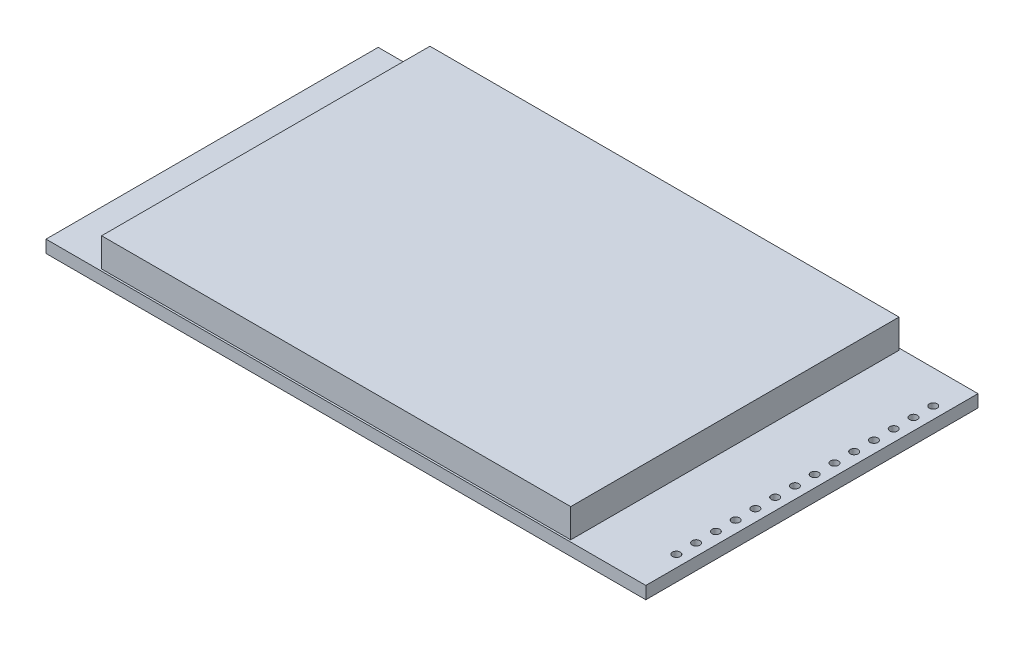
ISO-10303-21;
HEADER;
FILE_DESCRIPTION(('STEP AP214'),'2;1');
FILE_NAME('part.step','',(''),(''),'','','');
FILE_SCHEMA(('AUTOMOTIVE_DESIGN { 1 0 10303 214 1 1 1 1 }'));
ENDSEC;
DATA;
#1=APPLICATION_CONTEXT('core data for automotive mechanical design processes');
#2=APPLICATION_PROTOCOL_DEFINITION('international standard','automotive_design',2000,#1);
#3=PRODUCT_CONTEXT('',#1,'mechanical');
#4=PRODUCT('Part','Part','',(#3));
#5=PRODUCT_RELATED_PRODUCT_CATEGORY('part','',(#4));
#6=PRODUCT_DEFINITION_FORMATION('','',#4);
#7=PRODUCT_DEFINITION_CONTEXT('part definition',#1,'design');
#8=PRODUCT_DEFINITION('design','',#6,#7);
#9=PRODUCT_DEFINITION_SHAPE('','',#8);
#10=(LENGTH_UNIT() NAMED_UNIT(*) SI_UNIT(.MILLI.,.METRE.));
#11=(NAMED_UNIT(*) PLANE_ANGLE_UNIT() SI_UNIT($,.RADIAN.));
#12=(NAMED_UNIT(*) SI_UNIT($,.STERADIAN.) SOLID_ANGLE_UNIT());
#13=UNCERTAINTY_MEASURE_WITH_UNIT(LENGTH_MEASURE(1.E-05),#10,'distance_accuracy_value','');
#14=(GEOMETRIC_REPRESENTATION_CONTEXT(3) GLOBAL_UNCERTAINTY_ASSIGNED_CONTEXT((#13)) GLOBAL_UNIT_ASSIGNED_CONTEXT((#10,
#11,#12)) REPRESENTATION_CONTEXT('',''));
#15=CARTESIAN_POINT('',(0.,0.,0.));
#16=DIRECTION('',(0.,0.,1.));
#17=DIRECTION('',(1.,0.,0.));
#18=AXIS2_PLACEMENT_3D('',#15,#16,#17);
#19=CARTESIAN_POINT('',(0.,1.6,0.));
#20=DIRECTION('',(0.,1.,0.));
#21=DIRECTION('',(0.,0.,1.));
#22=AXIS2_PLACEMENT_3D('',#19,#20,#21);
#23=PLANE('',#22);
#24=CARTESIAN_POINT('',(37.05,1.6,13.3832355077745));
#25=DIRECTION('',(0.,1.,0.));
#26=DIRECTION('',(0.,0.,1.));
#27=AXIS2_PLACEMENT_3D('',#24,#25,#26);
#28=CIRCLE('',#27,0.499999999999999);
#29=CARTESIAN_POINT('',(37.05,1.6,13.8832355077745));
#30=VERTEX_POINT('',#29);
#31=EDGE_CURVE('E267',#30,#30,#28,.T.);
#32=ORIENTED_EDGE('',*,*,#31,.F.);
#33=EDGE_LOOP('',(#32));
#34=FACE_BOUND('',#33,.T.);
#35=CARTESIAN_POINT('',(37.05,1.6,10.8432355077745));
#36=DIRECTION('',(0.,1.,0.));
#37=DIRECTION('',(0.,0.,1.));
#38=AXIS2_PLACEMENT_3D('',#35,#36,#37);
#39=CIRCLE('',#38,0.499999999999999);
#40=CARTESIAN_POINT('',(37.05,1.6,11.3432355077745));
#41=VERTEX_POINT('',#40);
#42=EDGE_CURVE('E278',#41,#41,#39,.T.);
#43=ORIENTED_EDGE('',*,*,#42,.F.);
#44=EDGE_LOOP('',(#43));
#45=FACE_BOUND('',#44,.T.);
#46=CARTESIAN_POINT('',(37.05,1.6,8.30323550777446));
#47=DIRECTION('',(0.,1.,0.));
#48=DIRECTION('',(0.,0.,1.));
#49=AXIS2_PLACEMENT_3D('',#46,#47,#48);
#50=CIRCLE('',#49,0.499999999999999);
#51=CARTESIAN_POINT('',(37.05,1.6,8.80323550777446));
#52=VERTEX_POINT('',#51);
#53=EDGE_CURVE('E284',#52,#52,#50,.T.);
#54=ORIENTED_EDGE('',*,*,#53,.F.);
#55=EDGE_LOOP('',(#54));
#56=FACE_BOUND('',#55,.T.);
#57=CARTESIAN_POINT('',(37.0499999999999,1.6,5.76323550777446));
#58=DIRECTION('',(0.,1.,0.));
#59=DIRECTION('',(0.,0.,1.));
#60=AXIS2_PLACEMENT_3D('',#57,#58,#59);
#61=CIRCLE('',#60,0.499999999999999);
#62=CARTESIAN_POINT('',(37.0499999999999,1.6,6.26323550777446));
#63=VERTEX_POINT('',#62);
#64=EDGE_CURVE('E290',#63,#63,#61,.T.);
#65=ORIENTED_EDGE('',*,*,#64,.F.);
#66=EDGE_LOOP('',(#65));
#67=FACE_BOUND('',#66,.T.);
#68=CARTESIAN_POINT('',(37.0499999999999,1.6,3.22323550777446));
#69=DIRECTION('',(0.,1.,0.));
#70=DIRECTION('',(0.,0.,1.));
#71=AXIS2_PLACEMENT_3D('',#68,#69,#70);
#72=CIRCLE('',#71,0.499999999999999);
#73=CARTESIAN_POINT('',(37.0499999999999,1.6,3.72323550777446));
#74=VERTEX_POINT('',#73);
#75=EDGE_CURVE('E296',#74,#74,#72,.T.);
#76=ORIENTED_EDGE('',*,*,#75,.F.);
#77=EDGE_LOOP('',(#76));
#78=FACE_BOUND('',#77,.T.);
#79=CARTESIAN_POINT('',(37.0499999999999,1.6,0.683235507774462));
#80=DIRECTION('',(0.,1.,0.));
#81=DIRECTION('',(0.,0.,1.));
#82=AXIS2_PLACEMENT_3D('',#79,#80,#81);
#83=CIRCLE('',#82,0.499999999999999);
#84=CARTESIAN_POINT('',(37.0499999999999,1.6,1.18323550777446));
#85=VERTEX_POINT('',#84);
#86=EDGE_CURVE('E302',#85,#85,#83,.T.);
#87=ORIENTED_EDGE('',*,*,#86,.F.);
#88=EDGE_LOOP('',(#87));
#89=FACE_BOUND('',#88,.T.);
#90=CARTESIAN_POINT('',(37.0499999999999,1.6,-1.85676449222554));
#91=DIRECTION('',(0.,1.,0.));
#92=DIRECTION('',(0.,0.,1.));
#93=AXIS2_PLACEMENT_3D('',#90,#91,#92);
#94=CIRCLE('',#93,0.499999999999999);
#95=CARTESIAN_POINT('',(37.0499999999999,1.6,-1.35676449222554));
#96=VERTEX_POINT('',#95);
#97=EDGE_CURVE('E308',#96,#96,#94,.T.);
#98=ORIENTED_EDGE('',*,*,#97,.F.);
#99=EDGE_LOOP('',(#98));
#100=FACE_BOUND('',#99,.T.);
#101=CARTESIAN_POINT('',(37.0499999999999,1.6,-4.39676449222554));
#102=DIRECTION('',(0.,1.,0.));
#103=DIRECTION('',(0.,0.,1.));
#104=AXIS2_PLACEMENT_3D('',#101,#102,#103);
#105=CIRCLE('',#104,0.499999999999999);
#106=CARTESIAN_POINT('',(37.0499999999999,1.6,-3.89676449222554));
#107=VERTEX_POINT('',#106);
#108=EDGE_CURVE('E314',#107,#107,#105,.T.);
#109=ORIENTED_EDGE('',*,*,#108,.F.);
#110=EDGE_LOOP('',(#109));
#111=FACE_BOUND('',#110,.T.);
#112=CARTESIAN_POINT('',(37.0499999999999,1.6,-6.93676449222554));
#113=DIRECTION('',(0.,1.,0.));
#114=DIRECTION('',(0.,0.,1.));
#115=AXIS2_PLACEMENT_3D('',#112,#113,#114);
#116=CIRCLE('',#115,0.499999999999999);
#117=CARTESIAN_POINT('',(37.0499999999999,1.6,-6.43676449222554));
#118=VERTEX_POINT('',#117);
#119=EDGE_CURVE('E320',#118,#118,#116,.T.);
#120=ORIENTED_EDGE('',*,*,#119,.F.);
#121=EDGE_LOOP('',(#120));
#122=FACE_BOUND('',#121,.T.);
#123=CARTESIAN_POINT('',(37.0499999999999,1.6,-9.47676449222553));
#124=DIRECTION('',(0.,1.,0.));
#125=DIRECTION('',(0.,0.,1.));
#126=AXIS2_PLACEMENT_3D('',#123,#124,#125);
#127=CIRCLE('',#126,0.499999999999999);
#128=CARTESIAN_POINT('',(37.0499999999999,1.6,-8.97676449222553));
#129=VERTEX_POINT('',#128);
#130=EDGE_CURVE('E326',#129,#129,#127,.T.);
#131=ORIENTED_EDGE('',*,*,#130,.F.);
#132=EDGE_LOOP('',(#131));
#133=FACE_BOUND('',#132,.T.);
#134=CARTESIAN_POINT('',(37.0499999999999,1.6,-12.0167644922255));
#135=DIRECTION('',(0.,1.,0.));
#136=DIRECTION('',(0.,0.,1.));
#137=AXIS2_PLACEMENT_3D('',#134,#135,#136);
#138=CIRCLE('',#137,0.499999999999999);
#139=CARTESIAN_POINT('',(37.0499999999999,1.6,-11.5167644922255));
#140=VERTEX_POINT('',#139);
#141=EDGE_CURVE('E332',#140,#140,#138,.T.);
#142=ORIENTED_EDGE('',*,*,#141,.F.);
#143=EDGE_LOOP('',(#142));
#144=FACE_BOUND('',#143,.T.);
#145=CARTESIAN_POINT('',(37.0499999999999,1.6,-14.5567644922255));
#146=DIRECTION('',(0.,1.,0.));
#147=DIRECTION('',(0.,0.,1.));
#148=AXIS2_PLACEMENT_3D('',#145,#146,#147);
#149=CIRCLE('',#148,0.499999999999999);
#150=CARTESIAN_POINT('',(37.0499999999999,1.6,-14.0567644922255));
#151=VERTEX_POINT('',#150);
#152=EDGE_CURVE('E338',#151,#151,#149,.T.);
#153=ORIENTED_EDGE('',*,*,#152,.F.);
#154=EDGE_LOOP('',(#153));
#155=FACE_BOUND('',#154,.T.);
#156=CARTESIAN_POINT('',(37.0499999999999,1.6,-17.0967644922255));
#157=DIRECTION('',(0.,1.,0.));
#158=DIRECTION('',(0.,0.,1.));
#159=AXIS2_PLACEMENT_3D('',#156,#157,#158);
#160=CIRCLE('',#159,0.499999999999999);
#161=CARTESIAN_POINT('',(37.0499999999999,1.6,-16.5967644922255));
#162=VERTEX_POINT('',#161);
#163=EDGE_CURVE('E344',#162,#162,#160,.T.);
#164=ORIENTED_EDGE('',*,*,#163,.F.);
#165=EDGE_LOOP('',(#164));
#166=FACE_BOUND('',#165,.T.);
#167=CARTESIAN_POINT('',(37.05,1.6,15.9232355077745));
#168=DIRECTION('',(0.,1.,0.));
#169=DIRECTION('',(0.,0.,1.));
#170=AXIS2_PLACEMENT_3D('',#167,#168,#169);
#171=CIRCLE('',#170,0.499999999999999);
#172=CARTESIAN_POINT('',(37.05,1.6,16.4232355077745));
#173=VERTEX_POINT('',#172);
#174=EDGE_CURVE('E271',#173,#173,#171,.T.);
#175=ORIENTED_EDGE('',*,*,#174,.F.);
#176=EDGE_LOOP('',(#175));
#177=FACE_BOUND('',#176,.T.);
#178=DIRECTION('',(0.,0.,1.));
#179=VECTOR('',#178,1.);
#180=CARTESIAN_POINT('',(-38.55,1.6,21.35));
#181=LINE('',#180,#179);
#182=CARTESIAN_POINT('',(-38.55,1.6,-21.35));
#183=VERTEX_POINT('',#182);
#184=CARTESIAN_POINT('',(-38.55,1.6,21.35));
#185=VERTEX_POINT('',#184);
#186=EDGE_CURVE('E149',#183,#185,#181,.T.);
#187=ORIENTED_EDGE('',*,*,#186,.T.);
#188=DIRECTION('',(1.,0.,0.));
#189=VECTOR('',#188,1.);
#190=CARTESIAN_POINT('',(38.55,1.6,21.35));
#191=LINE('',#190,#189);
#192=CARTESIAN_POINT('',(38.55,1.6,21.35));
#193=VERTEX_POINT('',#192);
#194=EDGE_CURVE('E89',#185,#193,#191,.T.);
#195=ORIENTED_EDGE('',*,*,#194,.T.);
#196=DIRECTION('',(0.,0.,-1.));
#197=VECTOR('',#196,1.);
#198=CARTESIAN_POINT('',(38.55,1.6,21.35));
#199=LINE('',#198,#197);
#200=CARTESIAN_POINT('',(38.55,1.6,-21.35));
#201=VERTEX_POINT('',#200);
#202=EDGE_CURVE('E152',#193,#201,#199,.T.);
#203=ORIENTED_EDGE('',*,*,#202,.T.);
#204=DIRECTION('',(-1.,0.,0.));
#205=VECTOR('',#204,1.);
#206=CARTESIAN_POINT('',(38.55,1.6,-21.35));
#207=LINE('',#206,#205);
#208=EDGE_CURVE('E61',#201,#183,#207,.T.);
#209=ORIENTED_EDGE('',*,*,#208,.T.);
#210=EDGE_LOOP('',(#187,#195,#203,#209));
#211=FACE_BOUND('',#210,.T.);
#212=DIRECTION('',(1.,0.,0.));
#213=VECTOR('',#212,1.);
#214=CARTESIAN_POINT('',(28.65,1.6,21.1));
#215=LINE('',#214,#213);
#216=CARTESIAN_POINT('',(-31.65,1.6,21.1));
#217=VERTEX_POINT('',#216);
#218=CARTESIAN_POINT('',(28.65,1.6,21.1));
#219=VERTEX_POINT('',#218);
#220=EDGE_CURVE('E144',#217,#219,#215,.T.);
#221=ORIENTED_EDGE('',*,*,#220,.F.);
#222=DIRECTION('',(0.,0.,1.));
#223=VECTOR('',#222,1.);
#224=CARTESIAN_POINT('',(-31.65,1.6,21.1));
#225=LINE('',#224,#223);
#226=CARTESIAN_POINT('',(-31.65,1.6,-21.1));
#227=VERTEX_POINT('',#226);
#228=EDGE_CURVE('E138',#227,#217,#225,.T.);
#229=ORIENTED_EDGE('',*,*,#228,.F.);
#230=DIRECTION('',(-1.,0.,0.));
#231=VECTOR('',#230,1.);
#232=CARTESIAN_POINT('',(28.65,1.6,-21.1));
#233=LINE('',#232,#231);
#234=CARTESIAN_POINT('',(28.65,1.6,-21.1));
#235=VERTEX_POINT('',#234);
#236=EDGE_CURVE('E117',#235,#227,#233,.T.);
#237=ORIENTED_EDGE('',*,*,#236,.F.);
#238=DIRECTION('',(0.,0.,-1.));
#239=VECTOR('',#238,1.);
#240=CARTESIAN_POINT('',(28.65,1.6,21.1));
#241=LINE('',#240,#239);
#242=EDGE_CURVE('E52',#219,#235,#241,.T.);
#243=ORIENTED_EDGE('',*,*,#242,.F.);
#244=EDGE_LOOP('',(#221,#229,#237,#243));
#245=FACE_BOUND('',#244,.T.);
#246=ADVANCED_FACE('F37',(#34,#45,#56,#67,#78,#89,#100,#111,#122,#133,#144,#155,#166,#177,#211,
#245),#23,.T.);
#247=CARTESIAN_POINT('',(-38.55,1.6,21.35));
#248=DIRECTION('',(1.,0.,0.));
#249=DIRECTION('',(0.,0.,-1.));
#250=AXIS2_PLACEMENT_3D('',#247,#248,#249);
#251=PLANE('',#250);
#252=DIRECTION('',(0.,0.,1.));
#253=VECTOR('',#252,1.);
#254=CARTESIAN_POINT('',(-38.55,0.,21.35));
#255=LINE('',#254,#253);
#256=CARTESIAN_POINT('',(-38.55,0.,-21.35));
#257=VERTEX_POINT('',#256);
#258=CARTESIAN_POINT('',(-38.55,0.,21.35));
#259=VERTEX_POINT('',#258);
#260=EDGE_CURVE('E131',#257,#259,#255,.T.);
#261=ORIENTED_EDGE('',*,*,#260,.T.);
#262=DIRECTION('',(0.,-1.,0.));
#263=VECTOR('',#262,1.);
#264=CARTESIAN_POINT('',(-38.55,1.6,21.35));
#265=LINE('',#264,#263);
#266=EDGE_CURVE('E12',#185,#259,#265,.T.);
#267=ORIENTED_EDGE('',*,*,#266,.F.);
#268=ORIENTED_EDGE('',*,*,#186,.F.);
#269=DIRECTION('',(0.,-1.,0.));
#270=VECTOR('',#269,1.);
#271=CARTESIAN_POINT('',(-38.55,1.6,-21.35));
#272=LINE('',#271,#270);
#273=EDGE_CURVE('E154',#183,#257,#272,.T.);
#274=ORIENTED_EDGE('',*,*,#273,.T.);
#275=EDGE_LOOP('',(#261,#267,#268,#274));
#276=FACE_BOUND('',#275,.T.);
#277=ADVANCED_FACE('F39',(#276),#251,.F.);
#278=CARTESIAN_POINT('',(38.55,1.6,21.35));
#279=DIRECTION('',(0.,0.,-1.));
#280=DIRECTION('',(-1.,0.,0.));
#281=AXIS2_PLACEMENT_3D('',#278,#279,#280);
#282=PLANE('',#281);
#283=DIRECTION('',(1.,0.,0.));
#284=VECTOR('',#283,1.);
#285=CARTESIAN_POINT('',(38.55,0.,21.35));
#286=LINE('',#285,#284);
#287=CARTESIAN_POINT('',(38.55,0.,21.35));
#288=VERTEX_POINT('',#287);
#289=EDGE_CURVE('E134',#259,#288,#286,.T.);
#290=ORIENTED_EDGE('',*,*,#289,.T.);
#291=DIRECTION('',(0.,-1.,0.));
#292=VECTOR('',#291,1.);
#293=CARTESIAN_POINT('',(38.55,1.6,21.35));
#294=LINE('',#293,#292);
#295=EDGE_CURVE('E45',#193,#288,#294,.T.);
#296=ORIENTED_EDGE('',*,*,#295,.F.);
#297=ORIENTED_EDGE('',*,*,#194,.F.);
#298=ORIENTED_EDGE('',*,*,#266,.T.);
#299=EDGE_LOOP('',(#290,#296,#297,#298));
#300=FACE_BOUND('',#299,.T.);
#301=ADVANCED_FACE('F184',(#300),#282,.F.);
#302=CARTESIAN_POINT('',(38.55,1.6,21.35));
#303=DIRECTION('',(-1.,0.,0.));
#304=DIRECTION('',(0.,0.,1.));
#305=AXIS2_PLACEMENT_3D('',#302,#303,#304);
#306=PLANE('',#305);
#307=DIRECTION('',(0.,0.,-1.));
#308=VECTOR('',#307,1.);
#309=CARTESIAN_POINT('',(38.55,0.,21.35));
#310=LINE('',#309,#308);
#311=CARTESIAN_POINT('',(38.55,0.,-21.35));
#312=VERTEX_POINT('',#311);
#313=EDGE_CURVE('E157',#288,#312,#310,.T.);
#314=ORIENTED_EDGE('',*,*,#313,.T.);
#315=DIRECTION('',(0.,-1.,0.));
#316=VECTOR('',#315,1.);
#317=CARTESIAN_POINT('',(38.55,1.6,-21.35));
#318=LINE('',#317,#316);
#319=EDGE_CURVE('E161',#201,#312,#318,.T.);
#320=ORIENTED_EDGE('',*,*,#319,.F.);
#321=ORIENTED_EDGE('',*,*,#202,.F.);
#322=ORIENTED_EDGE('',*,*,#295,.T.);
#323=EDGE_LOOP('',(#314,#320,#321,#322));
#324=FACE_BOUND('',#323,.T.);
#325=ADVANCED_FACE('F166',(#324),#306,.F.);
#326=CARTESIAN_POINT('',(38.55,1.6,-21.35));
#327=DIRECTION('',(0.,0.,1.));
#328=DIRECTION('',(1.,0.,0.));
#329=AXIS2_PLACEMENT_3D('',#326,#327,#328);
#330=PLANE('',#329);
#331=DIRECTION('',(-1.,0.,0.));
#332=VECTOR('',#331,1.);
#333=CARTESIAN_POINT('',(38.55,0.,-21.35));
#334=LINE('',#333,#332);
#335=EDGE_CURVE('E82',#312,#257,#334,.T.);
#336=ORIENTED_EDGE('',*,*,#335,.T.);
#337=ORIENTED_EDGE('',*,*,#273,.F.);
#338=ORIENTED_EDGE('',*,*,#208,.F.);
#339=ORIENTED_EDGE('',*,*,#319,.T.);
#340=EDGE_LOOP('',(#336,#337,#338,#339));
#341=FACE_BOUND('',#340,.T.);
#342=ADVANCED_FACE('F174',(#341),#330,.F.);
#343=CARTESIAN_POINT('',(0.,0.,0.));
#344=DIRECTION('',(0.,1.,0.));
#345=DIRECTION('',(0.,0.,1.));
#346=AXIS2_PLACEMENT_3D('',#343,#344,#345);
#347=PLANE('',#346);
#348=CARTESIAN_POINT('',(37.05,0.,13.3832355077745));
#349=DIRECTION('',(0.,1.,0.));
#350=DIRECTION('',(0.,0.,1.));
#351=AXIS2_PLACEMENT_3D('',#348,#349,#350);
#352=CIRCLE('',#351,0.499999999999999);
#353=CARTESIAN_POINT('',(37.05,0.,13.8832355077745));
#354=VERTEX_POINT('',#353);
#355=EDGE_CURVE('E270',#354,#354,#352,.F.);
#356=ORIENTED_EDGE('',*,*,#355,.F.);
#357=EDGE_LOOP('',(#356));
#358=FACE_BOUND('',#357,.T.);
#359=CARTESIAN_POINT('',(37.05,0.,10.8432355077745));
#360=DIRECTION('',(0.,1.,0.));
#361=DIRECTION('',(0.,0.,1.));
#362=AXIS2_PLACEMENT_3D('',#359,#360,#361);
#363=CIRCLE('',#362,0.499999999999999);
#364=CARTESIAN_POINT('',(37.05,0.,11.3432355077745));
#365=VERTEX_POINT('',#364);
#366=EDGE_CURVE('E275',#365,#365,#363,.F.);
#367=ORIENTED_EDGE('',*,*,#366,.F.);
#368=EDGE_LOOP('',(#367));
#369=FACE_BOUND('',#368,.T.);
#370=CARTESIAN_POINT('',(37.05,0.,8.30323550777446));
#371=DIRECTION('',(0.,1.,0.));
#372=DIRECTION('',(0.,0.,1.));
#373=AXIS2_PLACEMENT_3D('',#370,#371,#372);
#374=CIRCLE('',#373,0.499999999999999);
#375=CARTESIAN_POINT('',(37.05,0.,8.80323550777446));
#376=VERTEX_POINT('',#375);
#377=EDGE_CURVE('E281',#376,#376,#374,.F.);
#378=ORIENTED_EDGE('',*,*,#377,.F.);
#379=EDGE_LOOP('',(#378));
#380=FACE_BOUND('',#379,.T.);
#381=CARTESIAN_POINT('',(37.0499999999999,0.,5.76323550777446));
#382=DIRECTION('',(0.,1.,0.));
#383=DIRECTION('',(0.,0.,1.));
#384=AXIS2_PLACEMENT_3D('',#381,#382,#383);
#385=CIRCLE('',#384,0.499999999999999);
#386=CARTESIAN_POINT('',(37.0499999999999,0.,6.26323550777446));
#387=VERTEX_POINT('',#386);
#388=EDGE_CURVE('E287',#387,#387,#385,.F.);
#389=ORIENTED_EDGE('',*,*,#388,.F.);
#390=EDGE_LOOP('',(#389));
#391=FACE_BOUND('',#390,.T.);
#392=CARTESIAN_POINT('',(37.0499999999999,0.,3.22323550777446));
#393=DIRECTION('',(0.,1.,0.));
#394=DIRECTION('',(0.,0.,1.));
#395=AXIS2_PLACEMENT_3D('',#392,#393,#394);
#396=CIRCLE('',#395,0.499999999999999);
#397=CARTESIAN_POINT('',(37.0499999999999,0.,3.72323550777446));
#398=VERTEX_POINT('',#397);
#399=EDGE_CURVE('E293',#398,#398,#396,.F.);
#400=ORIENTED_EDGE('',*,*,#399,.F.);
#401=EDGE_LOOP('',(#400));
#402=FACE_BOUND('',#401,.T.);
#403=CARTESIAN_POINT('',(37.0499999999999,0.,0.683235507774462));
#404=DIRECTION('',(0.,1.,0.));
#405=DIRECTION('',(0.,0.,1.));
#406=AXIS2_PLACEMENT_3D('',#403,#404,#405);
#407=CIRCLE('',#406,0.499999999999999);
#408=CARTESIAN_POINT('',(37.0499999999999,0.,1.18323550777446));
#409=VERTEX_POINT('',#408);
#410=EDGE_CURVE('E299',#409,#409,#407,.F.);
#411=ORIENTED_EDGE('',*,*,#410,.F.);
#412=EDGE_LOOP('',(#411));
#413=FACE_BOUND('',#412,.T.);
#414=CARTESIAN_POINT('',(37.0499999999999,0.,-1.85676449222554));
#415=DIRECTION('',(0.,1.,0.));
#416=DIRECTION('',(0.,0.,1.));
#417=AXIS2_PLACEMENT_3D('',#414,#415,#416);
#418=CIRCLE('',#417,0.499999999999999);
#419=CARTESIAN_POINT('',(37.0499999999999,0.,-1.35676449222554));
#420=VERTEX_POINT('',#419);
#421=EDGE_CURVE('E305',#420,#420,#418,.F.);
#422=ORIENTED_EDGE('',*,*,#421,.F.);
#423=EDGE_LOOP('',(#422));
#424=FACE_BOUND('',#423,.T.);
#425=CARTESIAN_POINT('',(37.0499999999999,0.,-4.39676449222554));
#426=DIRECTION('',(0.,1.,0.));
#427=DIRECTION('',(0.,0.,1.));
#428=AXIS2_PLACEMENT_3D('',#425,#426,#427);
#429=CIRCLE('',#428,0.499999999999999);
#430=CARTESIAN_POINT('',(37.0499999999999,0.,-3.89676449222554));
#431=VERTEX_POINT('',#430);
#432=EDGE_CURVE('E311',#431,#431,#429,.F.);
#433=ORIENTED_EDGE('',*,*,#432,.F.);
#434=EDGE_LOOP('',(#433));
#435=FACE_BOUND('',#434,.T.);
#436=CARTESIAN_POINT('',(37.0499999999999,0.,-6.93676449222554));
#437=DIRECTION('',(0.,1.,0.));
#438=DIRECTION('',(0.,0.,1.));
#439=AXIS2_PLACEMENT_3D('',#436,#437,#438);
#440=CIRCLE('',#439,0.499999999999999);
#441=CARTESIAN_POINT('',(37.0499999999999,0.,-6.43676449222554));
#442=VERTEX_POINT('',#441);
#443=EDGE_CURVE('E317',#442,#442,#440,.F.);
#444=ORIENTED_EDGE('',*,*,#443,.F.);
#445=EDGE_LOOP('',(#444));
#446=FACE_BOUND('',#445,.T.);
#447=CARTESIAN_POINT('',(37.0499999999999,0.,-9.47676449222553));
#448=DIRECTION('',(0.,1.,0.));
#449=DIRECTION('',(0.,0.,1.));
#450=AXIS2_PLACEMENT_3D('',#447,#448,#449);
#451=CIRCLE('',#450,0.499999999999999);
#452=CARTESIAN_POINT('',(37.0499999999999,0.,-8.97676449222553));
#453=VERTEX_POINT('',#452);
#454=EDGE_CURVE('E323',#453,#453,#451,.F.);
#455=ORIENTED_EDGE('',*,*,#454,.F.);
#456=EDGE_LOOP('',(#455));
#457=FACE_BOUND('',#456,.T.);
#458=CARTESIAN_POINT('',(37.0499999999999,0.,-12.0167644922255));
#459=DIRECTION('',(0.,1.,0.));
#460=DIRECTION('',(0.,0.,1.));
#461=AXIS2_PLACEMENT_3D('',#458,#459,#460);
#462=CIRCLE('',#461,0.499999999999999);
#463=CARTESIAN_POINT('',(37.0499999999999,0.,-11.5167644922255));
#464=VERTEX_POINT('',#463);
#465=EDGE_CURVE('E329',#464,#464,#462,.F.);
#466=ORIENTED_EDGE('',*,*,#465,.F.);
#467=EDGE_LOOP('',(#466));
#468=FACE_BOUND('',#467,.T.);
#469=CARTESIAN_POINT('',(37.0499999999999,0.,-14.5567644922255));
#470=DIRECTION('',(0.,1.,0.));
#471=DIRECTION('',(0.,0.,1.));
#472=AXIS2_PLACEMENT_3D('',#469,#470,#471);
#473=CIRCLE('',#472,0.499999999999999);
#474=CARTESIAN_POINT('',(37.0499999999999,0.,-14.0567644922255));
#475=VERTEX_POINT('',#474);
#476=EDGE_CURVE('E335',#475,#475,#473,.F.);
#477=ORIENTED_EDGE('',*,*,#476,.F.);
#478=EDGE_LOOP('',(#477));
#479=FACE_BOUND('',#478,.T.);
#480=CARTESIAN_POINT('',(37.0499999999999,0.,-17.0967644922255));
#481=DIRECTION('',(0.,1.,0.));
#482=DIRECTION('',(0.,0.,1.));
#483=AXIS2_PLACEMENT_3D('',#480,#481,#482);
#484=CIRCLE('',#483,0.499999999999999);
#485=CARTESIAN_POINT('',(37.0499999999999,0.,-16.5967644922255));
#486=VERTEX_POINT('',#485);
#487=EDGE_CURVE('E341',#486,#486,#484,.F.);
#488=ORIENTED_EDGE('',*,*,#487,.F.);
#489=EDGE_LOOP('',(#488));
#490=FACE_BOUND('',#489,.T.);
#491=CARTESIAN_POINT('',(37.05,0.,15.9232355077745));
#492=DIRECTION('',(0.,1.,0.));
#493=DIRECTION('',(0.,0.,1.));
#494=AXIS2_PLACEMENT_3D('',#491,#492,#493);
#495=CIRCLE('',#494,0.499999999999999);
#496=CARTESIAN_POINT('',(37.05,0.,16.4232355077745));
#497=VERTEX_POINT('',#496);
#498=EDGE_CURVE('E148',#497,#497,#495,.F.);
#499=ORIENTED_EDGE('',*,*,#498,.F.);
#500=EDGE_LOOP('',(#499));
#501=FACE_BOUND('',#500,.T.);
#502=ORIENTED_EDGE('',*,*,#260,.F.);
#503=ORIENTED_EDGE('',*,*,#335,.F.);
#504=ORIENTED_EDGE('',*,*,#313,.F.);
#505=ORIENTED_EDGE('',*,*,#289,.F.);
#506=EDGE_LOOP('',(#502,#503,#504,#505));
#507=FACE_BOUND('',#506,.T.);
#508=ADVANCED_FACE('F170',(#358,#369,#380,#391,#402,#413,#424,#435,#446,#457,#468,#479,#490,
#501,#507),#347,.F.);
#509=CARTESIAN_POINT('',(-31.65,84.19979619537,21.1));
#510=DIRECTION('',(1.,0.,0.));
#511=DIRECTION('',(0.,0.,-1.));
#512=AXIS2_PLACEMENT_3D('',#509,#510,#511);
#513=PLANE('',#512);
#514=DIRECTION('',(0.,0.,1.));
#515=VECTOR('',#514,1.);
#516=CARTESIAN_POINT('',(-31.65,5.3,21.1));
#517=LINE('',#516,#515);
#518=CARTESIAN_POINT('',(-31.65,5.3,-21.1));
#519=VERTEX_POINT('',#518);
#520=CARTESIAN_POINT('',(-31.65,5.3,21.1));
#521=VERTEX_POINT('',#520);
#522=EDGE_CURVE('E126',#519,#521,#517,.T.);
#523=ORIENTED_EDGE('',*,*,#522,.F.);
#524=DIRECTION('',(0.,-1.,0.));
#525=VECTOR('',#524,1.);
#526=CARTESIAN_POINT('',(-31.65,84.19979619537,-21.1));
#527=LINE('',#526,#525);
#528=EDGE_CURVE('E122',#519,#227,#527,.T.);
#529=ORIENTED_EDGE('',*,*,#528,.T.);
#530=ORIENTED_EDGE('',*,*,#228,.T.);
#531=DIRECTION('',(0.,-1.,0.));
#532=VECTOR('',#531,1.);
#533=CARTESIAN_POINT('',(-31.65,84.19979619537,21.1));
#534=LINE('',#533,#532);
#535=EDGE_CURVE('E142',#521,#217,#534,.T.);
#536=ORIENTED_EDGE('',*,*,#535,.F.);
#537=EDGE_LOOP('',(#523,#529,#530,#536));
#538=FACE_BOUND('',#537,.T.);
#539=ADVANCED_FACE('F181',(#538),#513,.F.);
#540=CARTESIAN_POINT('',(28.65,84.19979619537,21.1));
#541=DIRECTION('',(0.,0.,-1.));
#542=DIRECTION('',(-1.,0.,0.));
#543=AXIS2_PLACEMENT_3D('',#540,#541,#542);
#544=PLANE('',#543);
#545=DIRECTION('',(1.,0.,0.));
#546=VECTOR('',#545,1.);
#547=CARTESIAN_POINT('',(28.65,5.3,21.1));
#548=LINE('',#547,#546);
#549=CARTESIAN_POINT('',(28.65,5.3,21.1));
#550=VERTEX_POINT('',#549);
#551=EDGE_CURVE('E130',#521,#550,#548,.T.);
#552=ORIENTED_EDGE('',*,*,#551,.F.);
#553=ORIENTED_EDGE('',*,*,#535,.T.);
#554=ORIENTED_EDGE('',*,*,#220,.T.);
#555=DIRECTION('',(0.,-1.,0.));
#556=VECTOR('',#555,1.);
#557=CARTESIAN_POINT('',(28.65,84.19979619537,21.1));
#558=LINE('',#557,#556);
#559=EDGE_CURVE('E145',#550,#219,#558,.T.);
#560=ORIENTED_EDGE('',*,*,#559,.F.);
#561=EDGE_LOOP('',(#552,#553,#554,#560));
#562=FACE_BOUND('',#561,.T.);
#563=ADVANCED_FACE('F200',(#562),#544,.F.);
#564=CARTESIAN_POINT('',(28.65,84.19979619537,21.1));
#565=DIRECTION('',(-1.,0.,0.));
#566=DIRECTION('',(0.,0.,1.));
#567=AXIS2_PLACEMENT_3D('',#564,#565,#566);
#568=PLANE('',#567);
#569=DIRECTION('',(0.,0.,-1.));
#570=VECTOR('',#569,1.);
#571=CARTESIAN_POINT('',(28.65,5.3,21.1));
#572=LINE('',#571,#570);
#573=CARTESIAN_POINT('',(28.65,5.3,-21.1));
#574=VERTEX_POINT('',#573);
#575=EDGE_CURVE('E112',#550,#574,#572,.T.);
#576=ORIENTED_EDGE('',*,*,#575,.F.);
#577=ORIENTED_EDGE('',*,*,#559,.T.);
#578=ORIENTED_EDGE('',*,*,#242,.T.);
#579=DIRECTION('',(0.,-1.,0.));
#580=VECTOR('',#579,1.);
#581=CARTESIAN_POINT('',(28.65,84.19979619537,-21.1));
#582=LINE('',#581,#580);
#583=EDGE_CURVE('E108',#574,#235,#582,.T.);
#584=ORIENTED_EDGE('',*,*,#583,.F.);
#585=EDGE_LOOP('',(#576,#577,#578,#584));
#586=FACE_BOUND('',#585,.T.);
#587=ADVANCED_FACE('F110',(#586),#568,.F.);
#588=CARTESIAN_POINT('',(28.65,84.19979619537,-21.1));
#589=DIRECTION('',(0.,0.,1.));
#590=DIRECTION('',(1.,0.,0.));
#591=AXIS2_PLACEMENT_3D('',#588,#589,#590);
#592=PLANE('',#591);
#593=DIRECTION('',(-1.,0.,0.));
#594=VECTOR('',#593,1.);
#595=CARTESIAN_POINT('',(28.65,5.3,-21.1));
#596=LINE('',#595,#594);
#597=EDGE_CURVE('E120',#574,#519,#596,.T.);
#598=ORIENTED_EDGE('',*,*,#597,.F.);
#599=ORIENTED_EDGE('',*,*,#583,.T.);
#600=ORIENTED_EDGE('',*,*,#236,.T.);
#601=ORIENTED_EDGE('',*,*,#528,.F.);
#602=EDGE_LOOP('',(#598,#599,#600,#601));
#603=FACE_BOUND('',#602,.T.);
#604=ADVANCED_FACE('F121',(#603),#592,.F.);
#605=CARTESIAN_POINT('',(0.,5.3,0.));
#606=DIRECTION('',(0.,1.,0.));
#607=DIRECTION('',(0.,0.,1.));
#608=AXIS2_PLACEMENT_3D('',#605,#606,#607);
#609=PLANE('',#608);
#610=ORIENTED_EDGE('',*,*,#597,.T.);
#611=ORIENTED_EDGE('',*,*,#522,.T.);
#612=ORIENTED_EDGE('',*,*,#551,.T.);
#613=ORIENTED_EDGE('',*,*,#575,.T.);
#614=EDGE_LOOP('',(#610,#611,#612,#613));
#615=FACE_BOUND('',#614,.T.);
#616=ADVANCED_FACE('F129',(#615),#609,.T.);
#617=CARTESIAN_POINT('',(37.05,-0.000999999999999916,15.9232355077745));
#618=DIRECTION('',(0.,1.,0.));
#619=DIRECTION('',(0.,0.,1.));
#620=AXIS2_PLACEMENT_3D('',#617,#618,#619);
#621=CYLINDRICAL_SURFACE('',#620,0.499999999999999);
#622=ORIENTED_EDGE('',*,*,#174,.T.);
#623=EDGE_LOOP('',(#622));
#624=FACE_BOUND('',#623,.T.);
#625=ORIENTED_EDGE('',*,*,#498,.T.);
#626=EDGE_LOOP('',(#625));
#627=FACE_BOUND('',#626,.T.);
#628=ADVANCED_FACE('F197',(#624,#627),#621,.F.);
#629=CARTESIAN_POINT('',(37.0499999999999,-0.000999999999999916,-17.0967644922255));
#630=DIRECTION('',(0.,1.,0.));
#631=DIRECTION('',(0.,0.,1.));
#632=AXIS2_PLACEMENT_3D('',#629,#630,#631);
#633=CYLINDRICAL_SURFACE('',#632,0.499999999999999);
#634=ORIENTED_EDGE('',*,*,#163,.T.);
#635=EDGE_LOOP('',(#634));
#636=FACE_BOUND('',#635,.T.);
#637=ORIENTED_EDGE('',*,*,#487,.T.);
#638=EDGE_LOOP('',(#637));
#639=FACE_BOUND('',#638,.T.);
#640=ADVANCED_FACE('F211',(#636,#639),#633,.F.);
#641=CARTESIAN_POINT('',(37.0499999999999,-0.000999999999999916,-14.5567644922255));
#642=DIRECTION('',(0.,1.,0.));
#643=DIRECTION('',(0.,0.,1.));
#644=AXIS2_PLACEMENT_3D('',#641,#642,#643);
#645=CYLINDRICAL_SURFACE('',#644,0.499999999999999);
#646=ORIENTED_EDGE('',*,*,#152,.T.);
#647=EDGE_LOOP('',(#646));
#648=FACE_BOUND('',#647,.T.);
#649=ORIENTED_EDGE('',*,*,#476,.T.);
#650=EDGE_LOOP('',(#649));
#651=FACE_BOUND('',#650,.T.);
#652=ADVANCED_FACE('F215',(#648,#651),#645,.F.);
#653=CARTESIAN_POINT('',(37.0499999999999,-0.000999999999999916,-12.0167644922255));
#654=DIRECTION('',(0.,1.,0.));
#655=DIRECTION('',(0.,0.,1.));
#656=AXIS2_PLACEMENT_3D('',#653,#654,#655);
#657=CYLINDRICAL_SURFACE('',#656,0.499999999999999);
#658=ORIENTED_EDGE('',*,*,#141,.T.);
#659=EDGE_LOOP('',(#658));
#660=FACE_BOUND('',#659,.T.);
#661=ORIENTED_EDGE('',*,*,#465,.T.);
#662=EDGE_LOOP('',(#661));
#663=FACE_BOUND('',#662,.T.);
#664=ADVANCED_FACE('F219',(#660,#663),#657,.F.);
#665=CARTESIAN_POINT('',(37.0499999999999,-0.000999999999999916,-9.47676449222553));
#666=DIRECTION('',(0.,1.,0.));
#667=DIRECTION('',(0.,0.,1.));
#668=AXIS2_PLACEMENT_3D('',#665,#666,#667);
#669=CYLINDRICAL_SURFACE('',#668,0.499999999999999);
#670=ORIENTED_EDGE('',*,*,#130,.T.);
#671=EDGE_LOOP('',(#670));
#672=FACE_BOUND('',#671,.T.);
#673=ORIENTED_EDGE('',*,*,#454,.T.);
#674=EDGE_LOOP('',(#673));
#675=FACE_BOUND('',#674,.T.);
#676=ADVANCED_FACE('F223',(#672,#675),#669,.F.);
#677=CARTESIAN_POINT('',(37.0499999999999,-0.000999999999999916,-6.93676449222554));
#678=DIRECTION('',(0.,1.,0.));
#679=DIRECTION('',(0.,0.,1.));
#680=AXIS2_PLACEMENT_3D('',#677,#678,#679);
#681=CYLINDRICAL_SURFACE('',#680,0.499999999999999);
#682=ORIENTED_EDGE('',*,*,#119,.T.);
#683=EDGE_LOOP('',(#682));
#684=FACE_BOUND('',#683,.T.);
#685=ORIENTED_EDGE('',*,*,#443,.T.);
#686=EDGE_LOOP('',(#685));
#687=FACE_BOUND('',#686,.T.);
#688=ADVANCED_FACE('F227',(#684,#687),#681,.F.);
#689=CARTESIAN_POINT('',(37.0499999999999,-0.000999999999999916,-4.39676449222554));
#690=DIRECTION('',(0.,1.,0.));
#691=DIRECTION('',(0.,0.,1.));
#692=AXIS2_PLACEMENT_3D('',#689,#690,#691);
#693=CYLINDRICAL_SURFACE('',#692,0.499999999999999);
#694=ORIENTED_EDGE('',*,*,#108,.T.);
#695=EDGE_LOOP('',(#694));
#696=FACE_BOUND('',#695,.T.);
#697=ORIENTED_EDGE('',*,*,#432,.T.);
#698=EDGE_LOOP('',(#697));
#699=FACE_BOUND('',#698,.T.);
#700=ADVANCED_FACE('F231',(#696,#699),#693,.F.);
#701=CARTESIAN_POINT('',(37.0499999999999,-0.000999999999999916,-1.85676449222554));
#702=DIRECTION('',(0.,1.,0.));
#703=DIRECTION('',(0.,0.,1.));
#704=AXIS2_PLACEMENT_3D('',#701,#702,#703);
#705=CYLINDRICAL_SURFACE('',#704,0.499999999999999);
#706=ORIENTED_EDGE('',*,*,#97,.T.);
#707=EDGE_LOOP('',(#706));
#708=FACE_BOUND('',#707,.T.);
#709=ORIENTED_EDGE('',*,*,#421,.T.);
#710=EDGE_LOOP('',(#709));
#711=FACE_BOUND('',#710,.T.);
#712=ADVANCED_FACE('F235',(#708,#711),#705,.F.);
#713=CARTESIAN_POINT('',(37.0499999999999,-0.000999999999999916,0.683235507774462));
#714=DIRECTION('',(0.,1.,0.));
#715=DIRECTION('',(0.,0.,1.));
#716=AXIS2_PLACEMENT_3D('',#713,#714,#715);
#717=CYLINDRICAL_SURFACE('',#716,0.499999999999999);
#718=ORIENTED_EDGE('',*,*,#86,.T.);
#719=EDGE_LOOP('',(#718));
#720=FACE_BOUND('',#719,.T.);
#721=ORIENTED_EDGE('',*,*,#410,.T.);
#722=EDGE_LOOP('',(#721));
#723=FACE_BOUND('',#722,.T.);
#724=ADVANCED_FACE('F239',(#720,#723),#717,.F.);
#725=CARTESIAN_POINT('',(37.0499999999999,-0.000999999999999916,3.22323550777446));
#726=DIRECTION('',(0.,1.,0.));
#727=DIRECTION('',(0.,0.,1.));
#728=AXIS2_PLACEMENT_3D('',#725,#726,#727);
#729=CYLINDRICAL_SURFACE('',#728,0.499999999999999);
#730=ORIENTED_EDGE('',*,*,#75,.T.);
#731=EDGE_LOOP('',(#730));
#732=FACE_BOUND('',#731,.T.);
#733=ORIENTED_EDGE('',*,*,#399,.T.);
#734=EDGE_LOOP('',(#733));
#735=FACE_BOUND('',#734,.T.);
#736=ADVANCED_FACE('F243',(#732,#735),#729,.F.);
#737=CARTESIAN_POINT('',(37.0499999999999,-0.000999999999999916,5.76323550777446));
#738=DIRECTION('',(0.,1.,0.));
#739=DIRECTION('',(0.,0.,1.));
#740=AXIS2_PLACEMENT_3D('',#737,#738,#739);
#741=CYLINDRICAL_SURFACE('',#740,0.499999999999999);
#742=ORIENTED_EDGE('',*,*,#64,.T.);
#743=EDGE_LOOP('',(#742));
#744=FACE_BOUND('',#743,.T.);
#745=ORIENTED_EDGE('',*,*,#388,.T.);
#746=EDGE_LOOP('',(#745));
#747=FACE_BOUND('',#746,.T.);
#748=ADVANCED_FACE('F247',(#744,#747),#741,.F.);
#749=CARTESIAN_POINT('',(37.05,-0.000999999999999916,8.30323550777446));
#750=DIRECTION('',(0.,1.,0.));
#751=DIRECTION('',(0.,0.,1.));
#752=AXIS2_PLACEMENT_3D('',#749,#750,#751);
#753=CYLINDRICAL_SURFACE('',#752,0.499999999999999);
#754=ORIENTED_EDGE('',*,*,#53,.T.);
#755=EDGE_LOOP('',(#754));
#756=FACE_BOUND('',#755,.T.);
#757=ORIENTED_EDGE('',*,*,#377,.T.);
#758=EDGE_LOOP('',(#757));
#759=FACE_BOUND('',#758,.T.);
#760=ADVANCED_FACE('F251',(#756,#759),#753,.F.);
#761=CARTESIAN_POINT('',(37.05,-0.000999999999999916,10.8432355077745));
#762=DIRECTION('',(0.,1.,0.));
#763=DIRECTION('',(0.,0.,1.));
#764=AXIS2_PLACEMENT_3D('',#761,#762,#763);
#765=CYLINDRICAL_SURFACE('',#764,0.499999999999999);
#766=ORIENTED_EDGE('',*,*,#42,.T.);
#767=EDGE_LOOP('',(#766));
#768=FACE_BOUND('',#767,.T.);
#769=ORIENTED_EDGE('',*,*,#366,.T.);
#770=EDGE_LOOP('',(#769));
#771=FACE_BOUND('',#770,.T.);
#772=ADVANCED_FACE('F255',(#768,#771),#765,.F.);
#773=CARTESIAN_POINT('',(37.05,-0.000999999999999916,13.3832355077745));
#774=DIRECTION('',(0.,1.,0.));
#775=DIRECTION('',(0.,0.,1.));
#776=AXIS2_PLACEMENT_3D('',#773,#774,#775);
#777=CYLINDRICAL_SURFACE('',#776,0.499999999999999);
#778=ORIENTED_EDGE('',*,*,#31,.T.);
#779=EDGE_LOOP('',(#778));
#780=FACE_BOUND('',#779,.T.);
#781=ORIENTED_EDGE('',*,*,#355,.T.);
#782=EDGE_LOOP('',(#781));
#783=FACE_BOUND('',#782,.T.);
#784=ADVANCED_FACE('F259',(#780,#783),#777,.F.);
#785=CLOSED_SHELL('',(#246,#277,#301,#325,#342,#508,#539,#563,#587,#604,#616,#628,#640,#652,
#664,#676,#688,#700,#712,#724,#736,#748,#760,#772,#784));
#786=MANIFOLD_SOLID_BREP('B2',#785);
#787=ADVANCED_BREP_SHAPE_REPRESENTATION('',(#18,#786),#14);
#788=SHAPE_DEFINITION_REPRESENTATION(#9,#787);
ENDSEC;
END-ISO-10303-21;
